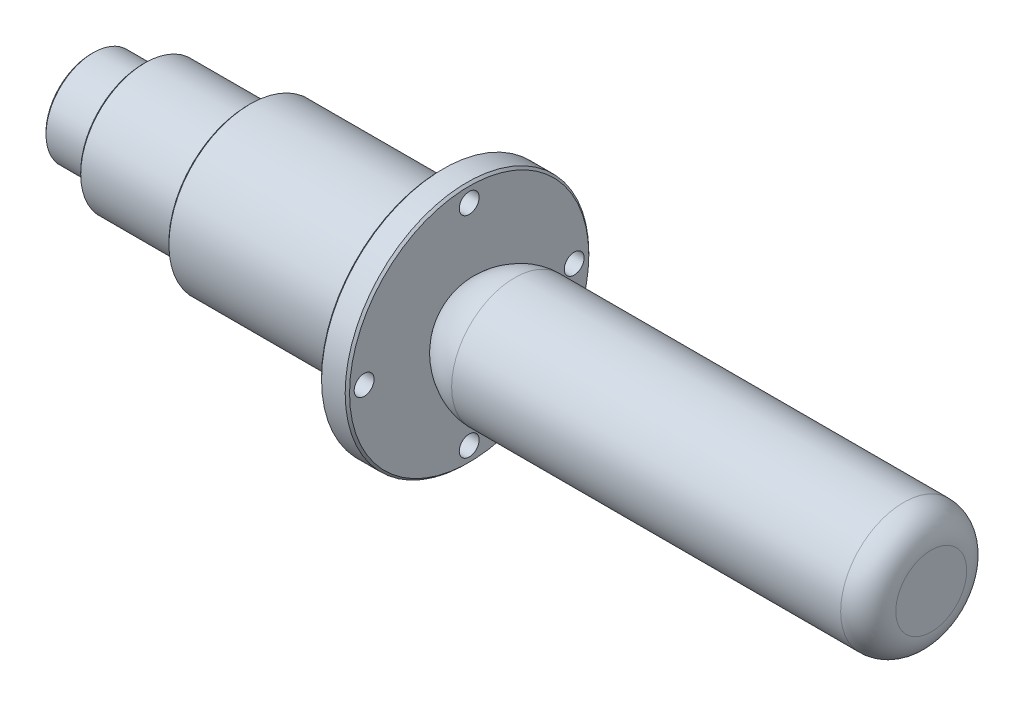
ISO-10303-21;
HEADER;
FILE_DESCRIPTION(('STEP AP214'),'2;1');
FILE_NAME('part.step','',(''),(''),'','','');
FILE_SCHEMA(('AUTOMOTIVE_DESIGN { 1 0 10303 214 1 1 1 1 }'));
ENDSEC;
DATA;
#1=APPLICATION_CONTEXT('core data for automotive mechanical design processes');
#2=APPLICATION_PROTOCOL_DEFINITION('international standard','automotive_design',2000,#1);
#3=PRODUCT_CONTEXT('',#1,'mechanical');
#4=PRODUCT('Part','Part','',(#3));
#5=PRODUCT_RELATED_PRODUCT_CATEGORY('part','',(#4));
#6=PRODUCT_DEFINITION_FORMATION('','',#4);
#7=PRODUCT_DEFINITION_CONTEXT('part definition',#1,'design');
#8=PRODUCT_DEFINITION('design','',#6,#7);
#9=PRODUCT_DEFINITION_SHAPE('','',#8);
#10=(LENGTH_UNIT() NAMED_UNIT(*) SI_UNIT(.MILLI.,.METRE.));
#11=(NAMED_UNIT(*) PLANE_ANGLE_UNIT() SI_UNIT($,.RADIAN.));
#12=(NAMED_UNIT(*) SI_UNIT($,.STERADIAN.) SOLID_ANGLE_UNIT());
#13=UNCERTAINTY_MEASURE_WITH_UNIT(LENGTH_MEASURE(1.E-05),#10,'distance_accuracy_value','');
#14=(GEOMETRIC_REPRESENTATION_CONTEXT(3) GLOBAL_UNCERTAINTY_ASSIGNED_CONTEXT((#13)) GLOBAL_UNIT_ASSIGNED_CONTEXT((#10,
#11,#12)) REPRESENTATION_CONTEXT('',''));
#15=CARTESIAN_POINT('',(0.,0.,0.));
#16=DIRECTION('',(0.,0.,1.));
#17=DIRECTION('',(1.,0.,0.));
#18=AXIS2_PLACEMENT_3D('',#15,#16,#17);
#19=CARTESIAN_POINT('',(-19.6703495733554,0.,0.));
#20=DIRECTION('',(1.,0.,0.));
#21=DIRECTION('',(0.,0.,-1.));
#22=AXIS2_PLACEMENT_3D('',#19,#20,#21);
#23=PLANE('',#22);
#24=CARTESIAN_POINT('',(-19.6703495733554,0.,0.));
#25=DIRECTION('',(1.,0.,0.));
#26=DIRECTION('',(0.,0.,-1.));
#27=AXIS2_PLACEMENT_3D('',#24,#25,#26);
#28=CIRCLE('',#27,8.18376542572714);
#29=CARTESIAN_POINT('',(-19.6703495733554,0.,-8.18376542572714));
#30=VERTEX_POINT('',#29);
#31=EDGE_CURVE('E47',#30,#30,#28,.F.);
#32=ORIENTED_EDGE('',*,*,#31,.T.);
#33=EDGE_LOOP('',(#32));
#34=FACE_BOUND('',#33,.T.);
#35=ADVANCED_FACE('F40',(#34),#23,.F.);
#36=CARTESIAN_POINT('',(-19.6703495733554,0.,0.));
#37=DIRECTION('',(-1.,0.,0.));
#38=DIRECTION('',(0.,0.,1.));
#39=AXIS2_PLACEMENT_3D('',#36,#37,#38);
#40=CYLINDRICAL_SURFACE('',#39,8.58064042572712);
#41=CARTESIAN_POINT('',(-19.2734745733554,0.,0.));
#42=DIRECTION('',(1.,0.,0.));
#43=DIRECTION('',(0.,0.,-1.));
#44=AXIS2_PLACEMENT_3D('',#41,#42,#43);
#45=CIRCLE('',#44,8.58064042572712);
#46=CARTESIAN_POINT('',(-19.2734745733554,0.,-8.58064042572712));
#47=VERTEX_POINT('',#46);
#48=EDGE_CURVE('E10',#47,#47,#45,.T.);
#49=ORIENTED_EDGE('',*,*,#48,.T.);
#50=EDGE_LOOP('',(#49));
#51=FACE_BOUND('',#50,.T.);
#52=CARTESIAN_POINT('',(-10.2723495733554,0.,0.));
#53=DIRECTION('',(-1.,0.,0.));
#54=DIRECTION('',(0.,0.,1.));
#55=AXIS2_PLACEMENT_3D('',#52,#53,#54);
#56=CIRCLE('',#55,8.58064042572712);
#57=CARTESIAN_POINT('',(-10.2723495733554,0.,8.58064042572712));
#58=VERTEX_POINT('',#57);
#59=EDGE_CURVE('E78',#58,#58,#56,.T.);
#60=ORIENTED_EDGE('',*,*,#59,.T.);
#61=EDGE_LOOP('',(#60));
#62=FACE_BOUND('',#61,.T.);
#63=ADVANCED_FACE('F143',(#51,#62),#40,.T.);
#64=CARTESIAN_POINT('',(-10.2723495733554,8.58064042572712,0.));
#65=DIRECTION('',(1.,0.,0.));
#66=DIRECTION('',(0.,0.,-1.));
#67=AXIS2_PLACEMENT_3D('',#64,#65,#66);
#68=PLANE('',#67);
#69=CARTESIAN_POINT('',(-10.2723495733554,0.,0.));
#70=DIRECTION('',(1.,0.,0.));
#71=DIRECTION('',(0.,0.,-1.));
#72=AXIS2_PLACEMENT_3D('',#69,#70,#71);
#73=CIRCLE('',#72,11.287125);
#74=CARTESIAN_POINT('',(-10.2723495733554,0.,-11.287125));
#75=VERTEX_POINT('',#74);
#76=EDGE_CURVE('E55',#75,#75,#73,.F.);
#77=ORIENTED_EDGE('',*,*,#76,.T.);
#78=EDGE_LOOP('',(#77));
#79=FACE_BOUND('',#78,.T.);
#80=ORIENTED_EDGE('',*,*,#59,.F.);
#81=EDGE_LOOP('',(#80));
#82=FACE_BOUND('',#81,.T.);
#83=ADVANCED_FACE('F139',(#79,#82),#68,.F.);
#84=CARTESIAN_POINT('',(-19.6703495733554,0.,0.));
#85=DIRECTION('',(-1.,0.,0.));
#86=DIRECTION('',(0.,0.,1.));
#87=AXIS2_PLACEMENT_3D('',#84,#85,#86);
#88=CYLINDRICAL_SURFACE('',#87,11.684);
#89=CARTESIAN_POINT('',(-9.87547457335536,0.,0.));
#90=DIRECTION('',(1.,0.,0.));
#91=DIRECTION('',(0.,0.,-1.));
#92=AXIS2_PLACEMENT_3D('',#89,#90,#91);
#93=CIRCLE('',#92,11.684);
#94=CARTESIAN_POINT('',(-9.87547457335536,0.,-11.684));
#95=VERTEX_POINT('',#94);
#96=EDGE_CURVE('E51',#95,#95,#93,.T.);
#97=ORIENTED_EDGE('',*,*,#96,.T.);
#98=EDGE_LOOP('',(#97));
#99=FACE_BOUND('',#98,.T.);
#100=CARTESIAN_POINT('',(8.77765042664464,0.,0.));
#101=DIRECTION('',(-1.,0.,0.));
#102=DIRECTION('',(0.,0.,1.));
#103=AXIS2_PLACEMENT_3D('',#100,#101,#102);
#104=CIRCLE('',#103,11.684);
#105=CARTESIAN_POINT('',(8.77765042664464,0.,11.684));
#106=VERTEX_POINT('',#105);
#107=EDGE_CURVE('E81',#106,#106,#104,.T.);
#108=ORIENTED_EDGE('',*,*,#107,.T.);
#109=EDGE_LOOP('',(#108));
#110=FACE_BOUND('',#109,.T.);
#111=ADVANCED_FACE('F135',(#99,#110),#88,.T.);
#112=CARTESIAN_POINT('',(8.77765042664464,11.684,0.));
#113=DIRECTION('',(1.,0.,0.));
#114=DIRECTION('',(0.,0.,-1.));
#115=AXIS2_PLACEMENT_3D('',#112,#113,#114);
#116=PLANE('',#115);
#117=CARTESIAN_POINT('',(8.77765042664464,0.,0.));
#118=DIRECTION('',(1.,0.,0.));
#119=DIRECTION('',(0.,0.,-1.));
#120=AXIS2_PLACEMENT_3D('',#117,#118,#119);
#121=CIRCLE('',#120,14.335125);
#122=CARTESIAN_POINT('',(8.77765042664464,0.,-14.335125));
#123=VERTEX_POINT('',#122);
#124=EDGE_CURVE('E63',#123,#123,#121,.F.);
#125=ORIENTED_EDGE('',*,*,#124,.T.);
#126=EDGE_LOOP('',(#125));
#127=FACE_BOUND('',#126,.T.);
#128=ORIENTED_EDGE('',*,*,#107,.F.);
#129=EDGE_LOOP('',(#128));
#130=FACE_BOUND('',#129,.T.);
#131=ADVANCED_FACE('F131',(#127,#130),#116,.F.);
#132=CARTESIAN_POINT('',(-19.6703495733554,0.,0.));
#133=DIRECTION('',(-1.,0.,0.));
#134=DIRECTION('',(0.,0.,1.));
#135=AXIS2_PLACEMENT_3D('',#132,#133,#134);
#136=CYLINDRICAL_SURFACE('',#135,14.732);
#137=CARTESIAN_POINT('',(9.17452542664466,0.,0.));
#138=DIRECTION('',(1.,0.,0.));
#139=DIRECTION('',(0.,0.,-1.));
#140=AXIS2_PLACEMENT_3D('',#137,#138,#139);
#141=CIRCLE('',#140,14.732);
#142=CARTESIAN_POINT('',(9.17452542664466,0.,-14.732));
#143=VERTEX_POINT('',#142);
#144=EDGE_CURVE('E60',#143,#143,#141,.T.);
#145=ORIENTED_EDGE('',*,*,#144,.T.);
#146=EDGE_LOOP('',(#145));
#147=FACE_BOUND('',#146,.T.);
#148=CARTESIAN_POINT('',(43.8296504266446,0.,0.));
#149=DIRECTION('',(-1.,0.,0.));
#150=DIRECTION('',(0.,0.,1.));
#151=AXIS2_PLACEMENT_3D('',#148,#149,#150);
#152=CIRCLE('',#151,14.732);
#153=CARTESIAN_POINT('',(43.8296504266446,0.,14.732));
#154=VERTEX_POINT('',#153);
#155=EDGE_CURVE('E84',#154,#154,#152,.T.);
#156=ORIENTED_EDGE('',*,*,#155,.T.);
#157=EDGE_LOOP('',(#156));
#158=FACE_BOUND('',#157,.T.);
#159=ADVANCED_FACE('F127',(#147,#158),#136,.T.);
#160=CARTESIAN_POINT('',(43.8296504266446,14.732,0.));
#161=DIRECTION('',(1.,0.,0.));
#162=DIRECTION('',(0.,0.,-1.));
#163=AXIS2_PLACEMENT_3D('',#160,#161,#162);
#164=PLANE('',#163);
#165=CARTESIAN_POINT('',(43.8296504266446,0.,0.));
#166=DIRECTION('',(1.,0.,0.));
#167=DIRECTION('',(0.,0.,-1.));
#168=AXIS2_PLACEMENT_3D('',#165,#166,#167);
#169=CIRCLE('',#168,21.701125);
#170=CARTESIAN_POINT('',(43.8296504266446,0.,-21.701125));
#171=VERTEX_POINT('',#170);
#172=EDGE_CURVE('E66',#171,#171,#169,.F.);
#173=ORIENTED_EDGE('',*,*,#172,.T.);
#174=EDGE_LOOP('',(#173));
#175=FACE_BOUND('',#174,.T.);
#176=CARTESIAN_POINT('',(43.8296504266446,0.,-19.05));
#177=DIRECTION('',(1.,0.,0.));
#178=DIRECTION('',(0.,0.,-1.));
#179=AXIS2_PLACEMENT_3D('',#176,#177,#178);
#180=CIRCLE('',#179,1.8034);
#181=CARTESIAN_POINT('',(43.8296504266446,0.,-20.8534));
#182=VERTEX_POINT('',#181);
#183=EDGE_CURVE('E352',#182,#182,#180,.F.);
#184=ORIENTED_EDGE('',*,*,#183,.F.);
#185=EDGE_LOOP('',(#184));
#186=FACE_BOUND('',#185,.T.);
#187=CARTESIAN_POINT('',(43.8296504266446,-19.05,0.));
#188=DIRECTION('',(1.,0.,0.));
#189=DIRECTION('',(0.,0.,-1.));
#190=AXIS2_PLACEMENT_3D('',#187,#188,#189);
#191=CIRCLE('',#190,1.8034);
#192=CARTESIAN_POINT('',(43.8296504266446,-19.05,-1.8034));
#193=VERTEX_POINT('',#192);
#194=EDGE_CURVE('E364',#193,#193,#191,.F.);
#195=ORIENTED_EDGE('',*,*,#194,.F.);
#196=EDGE_LOOP('',(#195));
#197=FACE_BOUND('',#196,.T.);
#198=CARTESIAN_POINT('',(43.8296504266446,1.99538158514885E-13,19.05));
#199=DIRECTION('',(1.,0.,0.));
#200=DIRECTION('',(0.,0.,-1.));
#201=AXIS2_PLACEMENT_3D('',#198,#199,#200);
#202=CIRCLE('',#201,1.8034);
#203=CARTESIAN_POINT('',(43.8296504266446,1.99538158514885E-13,17.2466));
#204=VERTEX_POINT('',#203);
#205=EDGE_CURVE('E357',#204,#204,#202,.F.);
#206=ORIENTED_EDGE('',*,*,#205,.F.);
#207=EDGE_LOOP('',(#206));
#208=FACE_BOUND('',#207,.T.);
#209=CARTESIAN_POINT('',(43.8296504266446,19.05,0.));
#210=DIRECTION('',(1.,0.,0.));
#211=DIRECTION('',(0.,0.,-1.));
#212=AXIS2_PLACEMENT_3D('',#209,#210,#211);
#213=CIRCLE('',#212,1.8034);
#214=CARTESIAN_POINT('',(43.8296504266446,19.05,-1.8034));
#215=VERTEX_POINT('',#214);
#216=EDGE_CURVE('E99',#215,#215,#213,.F.);
#217=ORIENTED_EDGE('',*,*,#216,.F.);
#218=EDGE_LOOP('',(#217));
#219=FACE_BOUND('',#218,.T.);
#220=ORIENTED_EDGE('',*,*,#155,.F.);
#221=EDGE_LOOP('',(#220));
#222=FACE_BOUND('',#221,.T.);
#223=ADVANCED_FACE('F123',(#175,#186,#197,#208,#219,#222),#164,.F.);
#224=CARTESIAN_POINT('',(-19.6703495733554,0.,0.));
#225=DIRECTION('',(-1.,0.,0.));
#226=DIRECTION('',(0.,0.,1.));
#227=AXIS2_PLACEMENT_3D('',#224,#225,#226);
#228=CYLINDRICAL_SURFACE('',#227,22.098);
#229=CARTESIAN_POINT('',(48.5127754266446,0.,0.));
#230=DIRECTION('',(-1.,0.,0.));
#231=DIRECTION('',(0.,0.,1.));
#232=AXIS2_PLACEMENT_3D('',#229,#230,#231);
#233=CIRCLE('',#232,22.098);
#234=CARTESIAN_POINT('',(48.5127754266446,0.,22.098));
#235=VERTEX_POINT('',#234);
#236=EDGE_CURVE('E72',#235,#235,#233,.T.);
#237=ORIENTED_EDGE('',*,*,#236,.T.);
#238=EDGE_LOOP('',(#237));
#239=FACE_BOUND('',#238,.T.);
#240=CARTESIAN_POINT('',(44.2265254266446,0.,0.));
#241=DIRECTION('',(1.,0.,0.));
#242=DIRECTION('',(0.,0.,-1.));
#243=AXIS2_PLACEMENT_3D('',#240,#241,#242);
#244=CIRCLE('',#243,22.098);
#245=CARTESIAN_POINT('',(44.2265254266446,0.,-22.098));
#246=VERTEX_POINT('',#245);
#247=EDGE_CURVE('E75',#246,#246,#244,.T.);
#248=ORIENTED_EDGE('',*,*,#247,.T.);
#249=EDGE_LOOP('',(#248));
#250=FACE_BOUND('',#249,.T.);
#251=ADVANCED_FACE('F119',(#239,#250),#228,.T.);
#252=CARTESIAN_POINT('',(48.9096504266446,22.098,0.));
#253=DIRECTION('',(-1.,0.,0.));
#254=DIRECTION('',(0.,0.,1.));
#255=AXIS2_PLACEMENT_3D('',#252,#253,#254);
#256=PLANE('',#255);
#257=CARTESIAN_POINT('',(48.9096504266446,0.,0.));
#258=DIRECTION('',(-1.,0.,0.));
#259=DIRECTION('',(0.,0.,1.));
#260=AXIS2_PLACEMENT_3D('',#257,#258,#259);
#261=CIRCLE('',#260,21.701125);
#262=CARTESIAN_POINT('',(48.9096504266446,0.,21.701125));
#263=VERTEX_POINT('',#262);
#264=EDGE_CURVE('E69',#263,#263,#261,.F.);
#265=ORIENTED_EDGE('',*,*,#264,.T.);
#266=EDGE_LOOP('',(#265));
#267=FACE_BOUND('',#266,.T.);
#268=CARTESIAN_POINT('',(48.9096504266446,0.,-19.05));
#269=DIRECTION('',(1.,0.,0.));
#270=DIRECTION('',(0.,-1.,0.));
#271=AXIS2_PLACEMENT_3D('',#268,#269,#270);
#272=CIRCLE('',#271,1.8034);
#273=CARTESIAN_POINT('',(48.9096504266446,-1.80340000000007,-19.05));
#274=VERTEX_POINT('',#273);
#275=EDGE_CURVE('E354',#274,#274,#272,.T.);
#276=ORIENTED_EDGE('',*,*,#275,.F.);
#277=EDGE_LOOP('',(#276));
#278=FACE_BOUND('',#277,.T.);
#279=CARTESIAN_POINT('',(48.9096504266446,-19.05,0.));
#280=DIRECTION('',(1.,0.,0.));
#281=DIRECTION('',(0.,0.,1.));
#282=AXIS2_PLACEMENT_3D('',#279,#280,#281);
#283=CIRCLE('',#282,1.8034);
#284=CARTESIAN_POINT('',(48.9096504266446,-19.05,1.8034));
#285=VERTEX_POINT('',#284);
#286=EDGE_CURVE('E360',#285,#285,#283,.T.);
#287=ORIENTED_EDGE('',*,*,#286,.F.);
#288=EDGE_LOOP('',(#287));
#289=FACE_BOUND('',#288,.T.);
#290=CARTESIAN_POINT('',(48.9096504266446,1.99538158514885E-13,19.05));
#291=DIRECTION('',(1.,0.,0.));
#292=DIRECTION('',(0.,1.,0.));
#293=AXIS2_PLACEMENT_3D('',#290,#291,#292);
#294=CIRCLE('',#293,1.8034);
#295=CARTESIAN_POINT('',(48.9096504266446,1.8034000000002,19.05));
#296=VERTEX_POINT('',#295);
#297=EDGE_CURVE('E361',#296,#296,#294,.T.);
#298=ORIENTED_EDGE('',*,*,#297,.F.);
#299=EDGE_LOOP('',(#298));
#300=FACE_BOUND('',#299,.T.);
#301=CARTESIAN_POINT('',(48.9096504266446,19.05,0.));
#302=DIRECTION('',(1.,0.,0.));
#303=DIRECTION('',(0.,0.,-1.));
#304=AXIS2_PLACEMENT_3D('',#301,#302,#303);
#305=CIRCLE('',#304,1.8034);
#306=CARTESIAN_POINT('',(48.9096504266446,19.05,-1.8034));
#307=VERTEX_POINT('',#306);
#308=EDGE_CURVE('E348',#307,#307,#305,.T.);
#309=ORIENTED_EDGE('',*,*,#308,.F.);
#310=EDGE_LOOP('',(#309));
#311=FACE_BOUND('',#310,.T.);
#312=CARTESIAN_POINT('',(48.9096504266446,0.,0.));
#313=DIRECTION('',(-1.,0.,0.));
#314=DIRECTION('',(0.,0.,1.));
#315=AXIS2_PLACEMENT_3D('',#312,#313,#314);
#316=CIRCLE('',#315,7.0551932389312);
#317=CARTESIAN_POINT('',(48.9096504266446,0.,7.0551932389312));
#318=VERTEX_POINT('',#317);
#319=EDGE_CURVE('E87',#318,#318,#316,.T.);
#320=ORIENTED_EDGE('',*,*,#319,.T.);
#321=EDGE_LOOP('',(#320));
#322=FACE_BOUND('',#321,.T.);
#323=ADVANCED_FACE('F114',(#267,#278,#289,#300,#311,#322),#256,.F.);
#324=CARTESIAN_POINT('',(57.1559804293479,11.43,0.));
#325=CARTESIAN_POINT('',(54.0783101220883,11.43,0.));
#326=CARTESIAN_POINT('',(50.7457454685463,9.46940732218983,0.));
#327=CARTESIAN_POINT('',(48.9096504266446,7.0551932389312,0.));
#328=B_SPLINE_CURVE_WITH_KNOTS('',3,(#324,#325,#326,#327),.UNSPECIFIED.,.F.,.F.,(4,4),(0.,1.),.UNSPECIFIED.);
#329=CARTESIAN_POINT('',(-19.6703495733554,0.,0.));
#330=DIRECTION('',(-1.,0.,0.));
#331=AXIS1_PLACEMENT('',#329,#330);
#332=SURFACE_OF_REVOLUTION('',#328,#331);
#333=ORIENTED_EDGE('',*,*,#319,.F.);
#334=EDGE_LOOP('',(#333));
#335=FACE_BOUND('',#334,.T.);
#336=CARTESIAN_POINT('',(57.1559804293479,0.,0.));
#337=DIRECTION('',(-1.,0.,0.));
#338=DIRECTION('',(0.,0.,1.));
#339=AXIS2_PLACEMENT_3D('',#336,#337,#338);
#340=CIRCLE('',#339,11.43);
#341=CARTESIAN_POINT('',(57.1559804293479,0.,11.43));
#342=VERTEX_POINT('',#341);
#343=EDGE_CURVE('E90',#342,#342,#340,.T.);
#344=ORIENTED_EDGE('',*,*,#343,.T.);
#345=EDGE_LOOP('',(#344));
#346=FACE_BOUND('',#345,.T.);
#347=ADVANCED_FACE('F109',(#335,#346),#332,.T.);
#348=CARTESIAN_POINT('',(-19.6703495733554,0.,0.));
#349=DIRECTION('',(-1.,0.,0.));
#350=DIRECTION('',(0.,0.,1.));
#351=AXIS2_PLACEMENT_3D('',#348,#349,#350);
#352=CYLINDRICAL_SURFACE('',#351,11.43);
#353=ORIENTED_EDGE('',*,*,#343,.F.);
#354=EDGE_LOOP('',(#353));
#355=FACE_BOUND('',#354,.T.);
#356=CARTESIAN_POINT('',(127.729650426645,0.,0.));
#357=DIRECTION('',(-1.,0.,0.));
#358=DIRECTION('',(0.,0.,1.));
#359=AXIS2_PLACEMENT_3D('',#356,#357,#358);
#360=CIRCLE('',#359,11.43);
#361=CARTESIAN_POINT('',(127.729650426645,0.,11.43));
#362=VERTEX_POINT('',#361);
#363=EDGE_CURVE('E93',#362,#362,#360,.T.);
#364=ORIENTED_EDGE('',*,*,#363,.T.);
#365=EDGE_LOOP('',(#364));
#366=FACE_BOUND('',#365,.T.);
#367=ADVANCED_FACE('F113',(#355,#366),#352,.T.);
#368=CARTESIAN_POINT('',(127.729650426645,0.,0.));
#369=DIRECTION('',(-1.,0.,0.));
#370=DIRECTION('',(0.,0.,1.));
#371=AXIS2_PLACEMENT_3D('',#368,#369,#370);
#372=TOROIDAL_SURFACE('',#371,6.43,5.);
#373=ORIENTED_EDGE('',*,*,#363,.F.);
#374=EDGE_LOOP('',(#373));
#375=FACE_BOUND('',#374,.T.);
#376=CARTESIAN_POINT('',(132.729650426645,0.,0.));
#377=DIRECTION('',(-1.,0.,0.));
#378=DIRECTION('',(0.,0.,1.));
#379=AXIS2_PLACEMENT_3D('',#376,#377,#378);
#380=CIRCLE('',#379,6.43);
#381=CARTESIAN_POINT('',(132.729650426645,0.,6.43));
#382=VERTEX_POINT('',#381);
#383=EDGE_CURVE('E96',#382,#382,#380,.T.);
#384=ORIENTED_EDGE('',*,*,#383,.T.);
#385=EDGE_LOOP('',(#384));
#386=FACE_BOUND('',#385,.T.);
#387=ADVANCED_FACE('F307',(#375,#386),#372,.T.);
#388=CARTESIAN_POINT('',(132.729650426645,0.,0.));
#389=DIRECTION('',(-1.,0.,0.));
#390=DIRECTION('',(0.,0.,1.));
#391=AXIS2_PLACEMENT_3D('',#388,#389,#390);
#392=PLANE('',#391);
#393=ORIENTED_EDGE('',*,*,#383,.F.);
#394=EDGE_LOOP('',(#393));
#395=FACE_BOUND('',#394,.T.);
#396=ADVANCED_FACE('F296',(#395),#392,.F.);
#397=CARTESIAN_POINT('',(-19.6713495733554,19.05,0.));
#398=DIRECTION('',(1.,0.,0.));
#399=DIRECTION('',(0.,0.,-1.));
#400=AXIS2_PLACEMENT_3D('',#397,#398,#399);
#401=CYLINDRICAL_SURFACE('',#400,1.8034);
#402=ORIENTED_EDGE('',*,*,#308,.T.);
#403=EDGE_LOOP('',(#402));
#404=FACE_BOUND('',#403,.T.);
#405=ORIENTED_EDGE('',*,*,#216,.T.);
#406=EDGE_LOOP('',(#405));
#407=FACE_BOUND('',#406,.T.);
#408=ADVANCED_FACE('F286',(#404,#407),#401,.F.);
#409=CARTESIAN_POINT('',(-19.6713495733554,1.99538158514885E-13,19.05));
#410=DIRECTION('',(1.,0.,0.));
#411=DIRECTION('',(0.,0.,-1.));
#412=AXIS2_PLACEMENT_3D('',#409,#410,#411);
#413=CYLINDRICAL_SURFACE('',#412,1.8034);
#414=ORIENTED_EDGE('',*,*,#297,.T.);
#415=EDGE_LOOP('',(#414));
#416=FACE_BOUND('',#415,.T.);
#417=ORIENTED_EDGE('',*,*,#205,.T.);
#418=EDGE_LOOP('',(#417));
#419=FACE_BOUND('',#418,.T.);
#420=ADVANCED_FACE('F276',(#416,#419),#413,.F.);
#421=CARTESIAN_POINT('',(-19.6713495733554,-19.05,0.));
#422=DIRECTION('',(1.,0.,0.));
#423=DIRECTION('',(0.,0.,-1.));
#424=AXIS2_PLACEMENT_3D('',#421,#422,#423);
#425=CYLINDRICAL_SURFACE('',#424,1.8034);
#426=ORIENTED_EDGE('',*,*,#286,.T.);
#427=EDGE_LOOP('',(#426));
#428=FACE_BOUND('',#427,.T.);
#429=ORIENTED_EDGE('',*,*,#194,.T.);
#430=EDGE_LOOP('',(#429));
#431=FACE_BOUND('',#430,.T.);
#432=ADVANCED_FACE('F266',(#428,#431),#425,.F.);
#433=CARTESIAN_POINT('',(-19.6713495733554,0.,-19.05));
#434=DIRECTION('',(1.,0.,0.));
#435=DIRECTION('',(0.,0.,-1.));
#436=AXIS2_PLACEMENT_3D('',#433,#434,#435);
#437=CYLINDRICAL_SURFACE('',#436,1.8034);
#438=ORIENTED_EDGE('',*,*,#275,.T.);
#439=EDGE_LOOP('',(#438));
#440=FACE_BOUND('',#439,.T.);
#441=ORIENTED_EDGE('',*,*,#183,.T.);
#442=EDGE_LOOP('',(#441));
#443=FACE_BOUND('',#442,.T.);
#444=ADVANCED_FACE('F153',(#440,#443),#437,.F.);
#445=CARTESIAN_POINT('',(48.5127754266446,0.,0.));
#446=DIRECTION('',(-1.,0.,0.));
#447=DIRECTION('',(0.,0.,1.));
#448=AXIS2_PLACEMENT_3D('',#445,#446,#447);
#449=CONICAL_SURFACE('',#448,22.098,0.785398163397457);
#450=ORIENTED_EDGE('',*,*,#264,.F.);
#451=EDGE_LOOP('',(#450));
#452=FACE_BOUND('',#451,.T.);
#453=ORIENTED_EDGE('',*,*,#236,.F.);
#454=EDGE_LOOP('',(#453));
#455=FACE_BOUND('',#454,.T.);
#456=ADVANCED_FACE('F149',(#452,#455),#449,.T.);
#457=CARTESIAN_POINT('',(43.8296504266446,0.,0.));
#458=DIRECTION('',(1.,0.,0.));
#459=DIRECTION('',(0.,0.,-1.));
#460=AXIS2_PLACEMENT_3D('',#457,#458,#459);
#461=CONICAL_SURFACE('',#460,21.701125,0.785398163397427);
#462=ORIENTED_EDGE('',*,*,#247,.F.);
#463=EDGE_LOOP('',(#462));
#464=FACE_BOUND('',#463,.T.);
#465=ORIENTED_EDGE('',*,*,#172,.F.);
#466=EDGE_LOOP('',(#465));
#467=FACE_BOUND('',#466,.T.);
#468=ADVANCED_FACE('F152',(#464,#467),#461,.T.);
#469=CARTESIAN_POINT('',(8.77765042664464,0.,0.));
#470=DIRECTION('',(1.,0.,0.));
#471=DIRECTION('',(0.,0.,-1.));
#472=AXIS2_PLACEMENT_3D('',#469,#470,#471);
#473=CONICAL_SURFACE('',#472,14.335125,0.785398163397437);
#474=ORIENTED_EDGE('',*,*,#144,.F.);
#475=EDGE_LOOP('',(#474));
#476=FACE_BOUND('',#475,.T.);
#477=ORIENTED_EDGE('',*,*,#124,.F.);
#478=EDGE_LOOP('',(#477));
#479=FACE_BOUND('',#478,.T.);
#480=ADVANCED_FACE('F157',(#476,#479),#473,.T.);
#481=CARTESIAN_POINT('',(-10.2723495733554,0.,0.));
#482=DIRECTION('',(1.,0.,0.));
#483=DIRECTION('',(0.,0.,-1.));
#484=AXIS2_PLACEMENT_3D('',#481,#482,#483);
#485=CONICAL_SURFACE('',#484,11.287125,0.785398163397457);
#486=ORIENTED_EDGE('',*,*,#96,.F.);
#487=EDGE_LOOP('',(#486));
#488=FACE_BOUND('',#487,.T.);
#489=ORIENTED_EDGE('',*,*,#76,.F.);
#490=EDGE_LOOP('',(#489));
#491=FACE_BOUND('',#490,.T.);
#492=ADVANCED_FACE('F160',(#488,#491),#485,.T.);
#493=CARTESIAN_POINT('',(-19.6703495733554,0.,0.));
#494=DIRECTION('',(1.,0.,0.));
#495=DIRECTION('',(0.,0.,-1.));
#496=AXIS2_PLACEMENT_3D('',#493,#494,#495);
#497=CONICAL_SURFACE('',#496,8.18376542572714,0.78539816339744);
#498=ORIENTED_EDGE('',*,*,#48,.F.);
#499=EDGE_LOOP('',(#498));
#500=FACE_BOUND('',#499,.T.);
#501=ORIENTED_EDGE('',*,*,#31,.F.);
#502=EDGE_LOOP('',(#501));
#503=FACE_BOUND('',#502,.T.);
#504=ADVANCED_FACE('F42',(#500,#503),#497,.T.);
#505=CLOSED_SHELL('',(#35,#63,#83,#111,#131,#159,#223,#251,#323,#347,#367,#387,#396,#408,#420,
#432,#444,#456,#468,#480,#492,#504));
#506=MANIFOLD_SOLID_BREP('B2',#505);
#507=ADVANCED_BREP_SHAPE_REPRESENTATION('',(#18,#506),#14);
#508=SHAPE_DEFINITION_REPRESENTATION(#9,#507);
ENDSEC;
END-ISO-10303-21;
